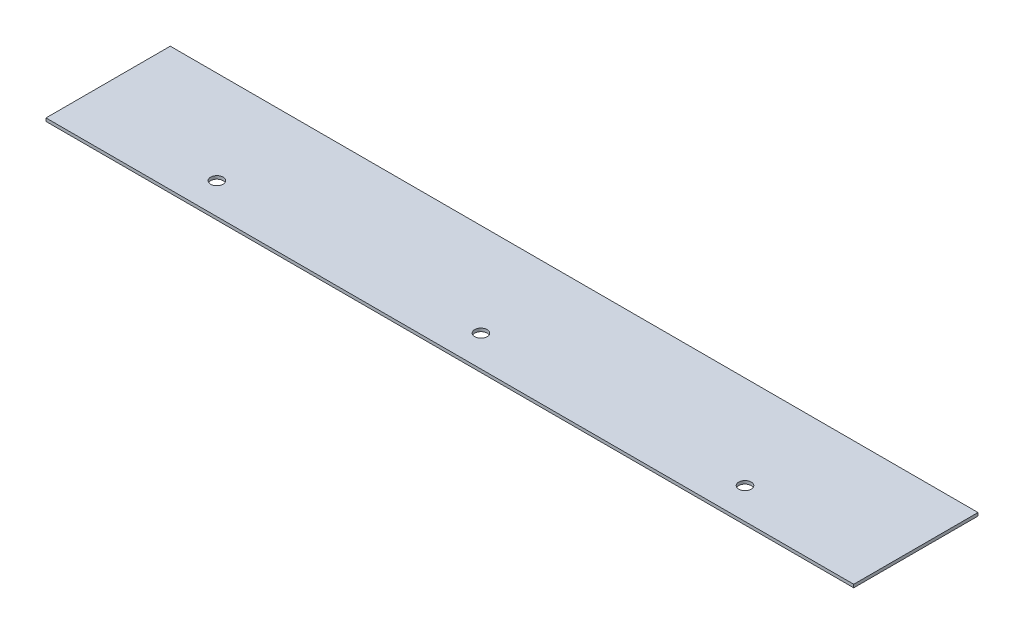
ISO-10303-21;
HEADER;
FILE_DESCRIPTION(('STEP AP214'),'2;1');
FILE_NAME('part.step','',(''),(''),'','','');
FILE_SCHEMA(('AUTOMOTIVE_DESIGN { 1 0 10303 214 1 1 1 1 }'));
ENDSEC;
DATA;
#1=APPLICATION_CONTEXT('core data for automotive mechanical design processes');
#2=APPLICATION_PROTOCOL_DEFINITION('international standard','automotive_design',2000,#1);
#3=PRODUCT_CONTEXT('',#1,'mechanical');
#4=PRODUCT('Part','Part','',(#3));
#5=PRODUCT_RELATED_PRODUCT_CATEGORY('part','',(#4));
#6=PRODUCT_DEFINITION_FORMATION('','',#4);
#7=PRODUCT_DEFINITION_CONTEXT('part definition',#1,'design');
#8=PRODUCT_DEFINITION('design','',#6,#7);
#9=PRODUCT_DEFINITION_SHAPE('','',#8);
#10=(LENGTH_UNIT() NAMED_UNIT(*) SI_UNIT(.MILLI.,.METRE.));
#11=(NAMED_UNIT(*) PLANE_ANGLE_UNIT() SI_UNIT($,.RADIAN.));
#12=(NAMED_UNIT(*) SI_UNIT($,.STERADIAN.) SOLID_ANGLE_UNIT());
#13=UNCERTAINTY_MEASURE_WITH_UNIT(LENGTH_MEASURE(1.E-05),#10,'distance_accuracy_value','');
#14=(GEOMETRIC_REPRESENTATION_CONTEXT(3) GLOBAL_UNCERTAINTY_ASSIGNED_CONTEXT((#13)) GLOBAL_UNIT_ASSIGNED_CONTEXT((#10,
#11,#12)) REPRESENTATION_CONTEXT('',''));
#15=CARTESIAN_POINT('',(0.,0.,0.));
#16=DIRECTION('',(0.,0.,1.));
#17=DIRECTION('',(1.,0.,0.));
#18=AXIS2_PLACEMENT_3D('',#15,#16,#17);
#19=CARTESIAN_POINT('',(130.,1.,0.));
#20=DIRECTION('',(1.,0.,0.));
#21=DIRECTION('',(0.,0.,-1.));
#22=AXIS2_PLACEMENT_3D('',#19,#20,#21);
#23=PLANE('',#22);
#24=DIRECTION('',(0.,0.,1.));
#25=VECTOR('',#24,1.);
#26=CARTESIAN_POINT('',(130.,0.,0.));
#27=LINE('',#26,#25);
#28=CARTESIAN_POINT('',(130.,0.,-30.));
#29=VERTEX_POINT('',#28);
#30=CARTESIAN_POINT('',(130.,0.,10.));
#31=VERTEX_POINT('',#30);
#32=EDGE_CURVE('E136',#29,#31,#27,.T.);
#33=ORIENTED_EDGE('',*,*,#32,.F.);
#34=DIRECTION('',(0.,-1.,0.));
#35=VECTOR('',#34,1.);
#36=CARTESIAN_POINT('',(130.,1.,-30.));
#37=LINE('',#36,#35);
#38=CARTESIAN_POINT('',(130.,1.,-30.));
#39=VERTEX_POINT('',#38);
#40=EDGE_CURVE('E11',#39,#29,#37,.T.);
#41=ORIENTED_EDGE('',*,*,#40,.F.);
#42=DIRECTION('',(0.,0.,1.));
#43=VECTOR('',#42,1.);
#44=CARTESIAN_POINT('',(130.,1.,0.));
#45=LINE('',#44,#43);
#46=CARTESIAN_POINT('',(130.,1.,10.));
#47=VERTEX_POINT('',#46);
#48=EDGE_CURVE('E112',#39,#47,#45,.T.);
#49=ORIENTED_EDGE('',*,*,#48,.T.);
#50=DIRECTION('',(0.,-1.,0.));
#51=VECTOR('',#50,1.);
#52=CARTESIAN_POINT('',(130.,1.,10.));
#53=LINE('',#52,#51);
#54=EDGE_CURVE('E88',#47,#31,#53,.T.);
#55=ORIENTED_EDGE('',*,*,#54,.T.);
#56=EDGE_LOOP('',(#33,#41,#49,#55));
#57=FACE_BOUND('',#56,.T.);
#58=ADVANCED_FACE('F40',(#57),#23,.T.);
#59=CARTESIAN_POINT('',(0.,1.,-30.));
#60=DIRECTION('',(0.,0.,-1.));
#61=DIRECTION('',(-1.,0.,0.));
#62=AXIS2_PLACEMENT_3D('',#59,#60,#61);
#63=PLANE('',#62);
#64=DIRECTION('',(1.,0.,0.));
#65=VECTOR('',#64,1.);
#66=CARTESIAN_POINT('',(0.,0.,-30.));
#67=LINE('',#66,#65);
#68=CARTESIAN_POINT('',(-130.,0.,-30.));
#69=VERTEX_POINT('',#68);
#70=EDGE_CURVE('E101',#69,#29,#67,.T.);
#71=ORIENTED_EDGE('',*,*,#70,.F.);
#72=DIRECTION('',(0.,-1.,0.));
#73=VECTOR('',#72,1.);
#74=CARTESIAN_POINT('',(-130.,1.,-30.));
#75=LINE('',#74,#73);
#76=CARTESIAN_POINT('',(-130.,1.,-30.));
#77=VERTEX_POINT('',#76);
#78=EDGE_CURVE('E50',#77,#69,#75,.T.);
#79=ORIENTED_EDGE('',*,*,#78,.F.);
#80=DIRECTION('',(1.,0.,0.));
#81=VECTOR('',#80,1.);
#82=CARTESIAN_POINT('',(0.,1.,-30.));
#83=LINE('',#82,#81);
#84=EDGE_CURVE('E99',#77,#39,#83,.T.);
#85=ORIENTED_EDGE('',*,*,#84,.T.);
#86=ORIENTED_EDGE('',*,*,#40,.T.);
#87=EDGE_LOOP('',(#71,#79,#85,#86));
#88=FACE_BOUND('',#87,.T.);
#89=ADVANCED_FACE('F97',(#88),#63,.T.);
#90=CARTESIAN_POINT('',(-130.,1.,0.));
#91=DIRECTION('',(1.,0.,0.));
#92=DIRECTION('',(0.,0.,-1.));
#93=AXIS2_PLACEMENT_3D('',#90,#91,#92);
#94=PLANE('',#93);
#95=DIRECTION('',(0.,0.,1.));
#96=VECTOR('',#95,1.);
#97=CARTESIAN_POINT('',(-130.,0.,0.));
#98=LINE('',#97,#96);
#99=CARTESIAN_POINT('',(-130.,0.,10.));
#100=VERTEX_POINT('',#99);
#101=EDGE_CURVE('E139',#69,#100,#98,.T.);
#102=ORIENTED_EDGE('',*,*,#101,.T.);
#103=DIRECTION('',(0.,-1.,0.));
#104=VECTOR('',#103,1.);
#105=CARTESIAN_POINT('',(-130.,1.,10.));
#106=LINE('',#105,#104);
#107=CARTESIAN_POINT('',(-130.,1.,10.));
#108=VERTEX_POINT('',#107);
#109=EDGE_CURVE('E105',#108,#100,#106,.T.);
#110=ORIENTED_EDGE('',*,*,#109,.F.);
#111=DIRECTION('',(0.,0.,1.));
#112=VECTOR('',#111,1.);
#113=CARTESIAN_POINT('',(-130.,1.,0.));
#114=LINE('',#113,#112);
#115=EDGE_CURVE('E107',#77,#108,#114,.T.);
#116=ORIENTED_EDGE('',*,*,#115,.F.);
#117=ORIENTED_EDGE('',*,*,#78,.T.);
#118=EDGE_LOOP('',(#102,#110,#116,#117));
#119=FACE_BOUND('',#118,.T.);
#120=ADVANCED_FACE('F108',(#119),#94,.F.);
#121=CARTESIAN_POINT('',(-85.,1.,0.));
#122=DIRECTION('',(0.,-1.,0.));
#123=DIRECTION('',(0.,0.,-1.));
#124=AXIS2_PLACEMENT_3D('',#121,#122,#123);
#125=CYLINDRICAL_SURFACE('',#124,2.);
#126=CARTESIAN_POINT('',(-85.,1.,0.));
#127=DIRECTION('',(0.,1.,0.));
#128=DIRECTION('',(0.,0.,1.));
#129=AXIS2_PLACEMENT_3D('',#126,#127,#128);
#130=CIRCLE('',#129,2.);
#131=CARTESIAN_POINT('',(-85.,1.,2.));
#132=VERTEX_POINT('',#131);
#133=EDGE_CURVE('E118',#132,#132,#130,.T.);
#134=ORIENTED_EDGE('',*,*,#133,.T.);
#135=EDGE_LOOP('',(#134));
#136=FACE_BOUND('',#135,.T.);
#137=CARTESIAN_POINT('',(-85.,0.,0.));
#138=DIRECTION('',(0.,1.,0.));
#139=DIRECTION('',(0.,0.,1.));
#140=AXIS2_PLACEMENT_3D('',#137,#138,#139);
#141=CIRCLE('',#140,2.);
#142=CARTESIAN_POINT('',(-85.,0.,2.));
#143=VERTEX_POINT('',#142);
#144=EDGE_CURVE('E132',#143,#143,#141,.T.);
#145=ORIENTED_EDGE('',*,*,#144,.F.);
#146=EDGE_LOOP('',(#145));
#147=FACE_BOUND('',#146,.T.);
#148=ADVANCED_FACE('F160',(#136,#147),#125,.F.);
#149=CARTESIAN_POINT('',(0.,1.,0.));
#150=DIRECTION('',(0.,-1.,0.));
#151=DIRECTION('',(0.,0.,-1.));
#152=AXIS2_PLACEMENT_3D('',#149,#150,#151);
#153=CYLINDRICAL_SURFACE('',#152,2.);
#154=CARTESIAN_POINT('',(0.,1.,0.));
#155=DIRECTION('',(0.,1.,0.));
#156=DIRECTION('',(0.,0.,1.));
#157=AXIS2_PLACEMENT_3D('',#154,#155,#156);
#158=CIRCLE('',#157,2.);
#159=CARTESIAN_POINT('',(0.,1.,2.));
#160=VERTEX_POINT('',#159);
#161=EDGE_CURVE('E173',#160,#160,#158,.T.);
#162=ORIENTED_EDGE('',*,*,#161,.T.);
#163=EDGE_LOOP('',(#162));
#164=FACE_BOUND('',#163,.T.);
#165=CARTESIAN_POINT('',(0.,0.,0.));
#166=DIRECTION('',(0.,1.,0.));
#167=DIRECTION('',(0.,0.,1.));
#168=AXIS2_PLACEMENT_3D('',#165,#166,#167);
#169=CIRCLE('',#168,2.);
#170=CARTESIAN_POINT('',(0.,0.,2.));
#171=VERTEX_POINT('',#170);
#172=EDGE_CURVE('E128',#171,#171,#169,.T.);
#173=ORIENTED_EDGE('',*,*,#172,.F.);
#174=EDGE_LOOP('',(#173));
#175=FACE_BOUND('',#174,.T.);
#176=ADVANCED_FACE('F162',(#164,#175),#153,.F.);
#177=CARTESIAN_POINT('',(85.,1.,0.));
#178=DIRECTION('',(0.,-1.,0.));
#179=DIRECTION('',(0.,0.,-1.));
#180=AXIS2_PLACEMENT_3D('',#177,#178,#179);
#181=CYLINDRICAL_SURFACE('',#180,2.);
#182=CARTESIAN_POINT('',(85.,1.,0.));
#183=DIRECTION('',(0.,1.,0.));
#184=DIRECTION('',(0.,0.,1.));
#185=AXIS2_PLACEMENT_3D('',#182,#183,#184);
#186=CIRCLE('',#185,2.);
#187=CARTESIAN_POINT('',(85.,1.,2.));
#188=VERTEX_POINT('',#187);
#189=EDGE_CURVE('E144',#188,#188,#186,.T.);
#190=ORIENTED_EDGE('',*,*,#189,.T.);
#191=EDGE_LOOP('',(#190));
#192=FACE_BOUND('',#191,.T.);
#193=CARTESIAN_POINT('',(85.,0.,0.));
#194=DIRECTION('',(0.,1.,0.));
#195=DIRECTION('',(0.,0.,1.));
#196=AXIS2_PLACEMENT_3D('',#193,#194,#195);
#197=CIRCLE('',#196,2.);
#198=CARTESIAN_POINT('',(85.,0.,2.));
#199=VERTEX_POINT('',#198);
#200=EDGE_CURVE('E124',#199,#199,#197,.T.);
#201=ORIENTED_EDGE('',*,*,#200,.F.);
#202=EDGE_LOOP('',(#201));
#203=FACE_BOUND('',#202,.T.);
#204=ADVANCED_FACE('F42',(#192,#203),#181,.F.);
#205=CARTESIAN_POINT('',(0.,1.,10.));
#206=DIRECTION('',(0.,0.,-1.));
#207=DIRECTION('',(-1.,0.,0.));
#208=AXIS2_PLACEMENT_3D('',#205,#206,#207);
#209=PLANE('',#208);
#210=DIRECTION('',(1.,0.,0.));
#211=VECTOR('',#210,1.);
#212=CARTESIAN_POINT('',(0.,0.,10.));
#213=LINE('',#212,#211);
#214=EDGE_CURVE('E81',#100,#31,#213,.T.);
#215=ORIENTED_EDGE('',*,*,#214,.T.);
#216=ORIENTED_EDGE('',*,*,#54,.F.);
#217=DIRECTION('',(1.,0.,0.));
#218=VECTOR('',#217,1.);
#219=CARTESIAN_POINT('',(0.,1.,10.));
#220=LINE('',#219,#218);
#221=EDGE_CURVE('E61',#108,#47,#220,.T.);
#222=ORIENTED_EDGE('',*,*,#221,.F.);
#223=ORIENTED_EDGE('',*,*,#109,.T.);
#224=EDGE_LOOP('',(#215,#216,#222,#223));
#225=FACE_BOUND('',#224,.T.);
#226=ADVANCED_FACE('F149',(#225),#209,.F.);
#227=CARTESIAN_POINT('',(0.,1.,0.));
#228=DIRECTION('',(0.,1.,0.));
#229=DIRECTION('',(0.,0.,1.));
#230=AXIS2_PLACEMENT_3D('',#227,#228,#229);
#231=PLANE('',#230);
#232=ORIENTED_EDGE('',*,*,#189,.F.);
#233=EDGE_LOOP('',(#232));
#234=FACE_BOUND('',#233,.T.);
#235=ORIENTED_EDGE('',*,*,#161,.F.);
#236=EDGE_LOOP('',(#235));
#237=FACE_BOUND('',#236,.T.);
#238=ORIENTED_EDGE('',*,*,#133,.F.);
#239=EDGE_LOOP('',(#238));
#240=FACE_BOUND('',#239,.T.);
#241=ORIENTED_EDGE('',*,*,#48,.F.);
#242=ORIENTED_EDGE('',*,*,#84,.F.);
#243=ORIENTED_EDGE('',*,*,#115,.T.);
#244=ORIENTED_EDGE('',*,*,#221,.T.);
#245=EDGE_LOOP('',(#241,#242,#243,#244));
#246=FACE_BOUND('',#245,.T.);
#247=ADVANCED_FACE('F111',(#234,#237,#240,#246),#231,.T.);
#248=CARTESIAN_POINT('',(0.,0.,0.));
#249=DIRECTION('',(0.,1.,0.));
#250=DIRECTION('',(0.,0.,1.));
#251=AXIS2_PLACEMENT_3D('',#248,#249,#250);
#252=PLANE('',#251);
#253=ORIENTED_EDGE('',*,*,#200,.T.);
#254=EDGE_LOOP('',(#253));
#255=FACE_BOUND('',#254,.T.);
#256=ORIENTED_EDGE('',*,*,#172,.T.);
#257=EDGE_LOOP('',(#256));
#258=FACE_BOUND('',#257,.T.);
#259=ORIENTED_EDGE('',*,*,#144,.T.);
#260=EDGE_LOOP('',(#259));
#261=FACE_BOUND('',#260,.T.);
#262=ORIENTED_EDGE('',*,*,#32,.T.);
#263=ORIENTED_EDGE('',*,*,#214,.F.);
#264=ORIENTED_EDGE('',*,*,#101,.F.);
#265=ORIENTED_EDGE('',*,*,#70,.T.);
#266=EDGE_LOOP('',(#262,#263,#264,#265));
#267=FACE_BOUND('',#266,.T.);
#268=ADVANCED_FACE('F150',(#255,#258,#261,#267),#252,.F.);
#269=CLOSED_SHELL('',(#58,#89,#120,#148,#176,#204,#226,#247,#268));
#270=MANIFOLD_SOLID_BREP('B2',#269);
#271=ADVANCED_BREP_SHAPE_REPRESENTATION('',(#18,#270),#14);
#272=SHAPE_DEFINITION_REPRESENTATION(#9,#271);
ENDSEC;
END-ISO-10303-21;
